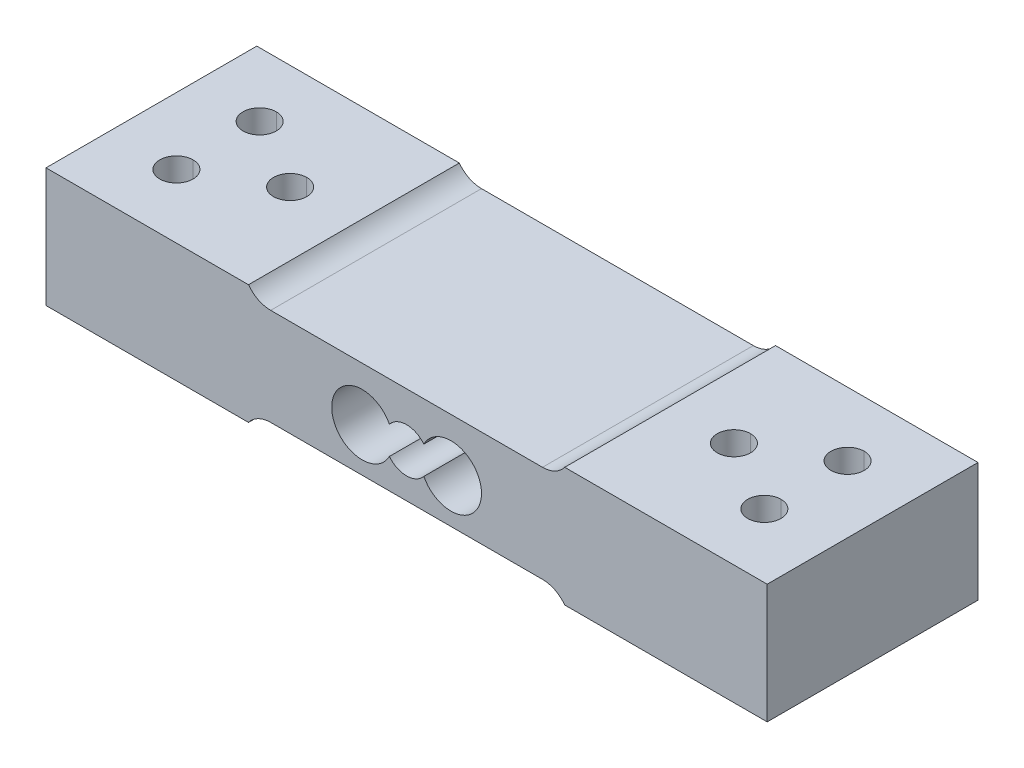
ISO-10303-21;
HEADER;
FILE_DESCRIPTION(('STEP AP214'),'2;1');
FILE_NAME('part.step','',(''),(''),'','','');
FILE_SCHEMA(('AUTOMOTIVE_DESIGN { 1 0 10303 214 1 1 1 1 }'));
ENDSEC;
DATA;
#1=APPLICATION_CONTEXT('core data for automotive mechanical design processes');
#2=APPLICATION_PROTOCOL_DEFINITION('international standard','automotive_design',2000,#1);
#3=PRODUCT_CONTEXT('',#1,'mechanical');
#4=PRODUCT('Part','Part','',(#3));
#5=PRODUCT_RELATED_PRODUCT_CATEGORY('part','',(#4));
#6=PRODUCT_DEFINITION_FORMATION('','',#4);
#7=PRODUCT_DEFINITION_CONTEXT('part definition',#1,'design');
#8=PRODUCT_DEFINITION('design','',#6,#7);
#9=PRODUCT_DEFINITION_SHAPE('','',#8);
#10=(LENGTH_UNIT() NAMED_UNIT(*) SI_UNIT(.MILLI.,.METRE.));
#11=(NAMED_UNIT(*) PLANE_ANGLE_UNIT() SI_UNIT($,.RADIAN.));
#12=(NAMED_UNIT(*) SI_UNIT($,.STERADIAN.) SOLID_ANGLE_UNIT());
#13=UNCERTAINTY_MEASURE_WITH_UNIT(LENGTH_MEASURE(1.E-05),#10,'distance_accuracy_value','');
#14=(GEOMETRIC_REPRESENTATION_CONTEXT(3) GLOBAL_UNCERTAINTY_ASSIGNED_CONTEXT((#13)) GLOBAL_UNIT_ASSIGNED_CONTEXT((#10,
#11,#12)) REPRESENTATION_CONTEXT('',''));
#15=CARTESIAN_POINT('',(0.,0.,0.));
#16=DIRECTION('',(0.,0.,1.));
#17=DIRECTION('',(1.,0.,0.));
#18=AXIS2_PLACEMENT_3D('',#15,#16,#17);
#19=CARTESIAN_POINT('',(0.,9.90073869788244,-19.001));
#20=DIRECTION('',(0.,0.,1.));
#21=DIRECTION('',(1.,0.,0.));
#22=AXIS2_PLACEMENT_3D('',#19,#20,#21);
#23=CYLINDRICAL_SURFACE('',#22,4.);
#24=CARTESIAN_POINT('',(0.,9.90073869788244,-19.));
#25=DIRECTION('',(0.,0.,-1.));
#26=DIRECTION('',(1.,0.,0.));
#27=AXIS2_PLACEMENT_3D('',#24,#25,#26);
#28=CIRCLE('',#27,4.);
#29=CARTESIAN_POINT('',(-3.109375,12.4170429540039,-19.));
#30=VERTEX_POINT('',#29);
#31=CARTESIAN_POINT('',(3.109375,12.4170429540039,-19.));
#32=VERTEX_POINT('',#31);
#33=EDGE_CURVE('E291',#30,#32,#28,.T.);
#34=ORIENTED_EDGE('',*,*,#33,.T.);
#35=DIRECTION('',(0.,0.,1.));
#36=VECTOR('',#35,1.);
#37=CARTESIAN_POINT('',(3.109375,12.4170429540039,-19.001));
#38=LINE('',#37,#36);
#39=CARTESIAN_POINT('',(3.109375,12.4170429540039,19.));
#40=VERTEX_POINT('',#39);
#41=EDGE_CURVE('E415',#32,#40,#38,.T.);
#42=ORIENTED_EDGE('',*,*,#41,.T.);
#43=CARTESIAN_POINT('',(0.,9.90073869788244,19.));
#44=DIRECTION('',(0.,0.,1.));
#45=DIRECTION('',(1.,0.,0.));
#46=AXIS2_PLACEMENT_3D('',#43,#44,#45);
#47=CIRCLE('',#46,4.);
#48=CARTESIAN_POINT('',(-3.109375,12.4170429540039,19.));
#49=VERTEX_POINT('',#48);
#50=EDGE_CURVE('E312',#40,#49,#47,.T.);
#51=ORIENTED_EDGE('',*,*,#50,.T.);
#52=DIRECTION('',(0.,0.,1.));
#53=VECTOR('',#52,1.);
#54=CARTESIAN_POINT('',(-3.109375,12.4170429540039,-19.001));
#55=LINE('',#54,#53);
#56=EDGE_CURVE('E11',#30,#49,#55,.T.);
#57=ORIENTED_EDGE('',*,*,#56,.F.);
#58=EDGE_LOOP('',(#34,#42,#51,#57));
#59=FACE_BOUND('',#58,.T.);
#60=ADVANCED_FACE('F16',(#59),#23,.F.);
#61=CARTESIAN_POINT('',(-8.,9.90073869788244,-19.001));
#62=DIRECTION('',(0.,0.,1.));
#63=DIRECTION('',(1.,0.,0.));
#64=AXIS2_PLACEMENT_3D('',#61,#62,#63);
#65=CYLINDRICAL_SURFACE('',#64,5.5);
#66=CARTESIAN_POINT('',(-8.,9.90073869788244,-19.));
#67=DIRECTION('',(0.,0.,-1.));
#68=DIRECTION('',(1.,0.,0.));
#69=AXIS2_PLACEMENT_3D('',#66,#67,#68);
#70=CIRCLE('',#69,5.5);
#71=CARTESIAN_POINT('',(-3.109375,7.38443444176097,-19.));
#72=VERTEX_POINT('',#71);
#73=EDGE_CURVE('E395',#72,#30,#70,.T.);
#74=ORIENTED_EDGE('',*,*,#73,.T.);
#75=ORIENTED_EDGE('',*,*,#56,.T.);
#76=CARTESIAN_POINT('',(-8.,9.90073869788244,19.));
#77=DIRECTION('',(0.,0.,1.));
#78=DIRECTION('',(1.,0.,0.));
#79=AXIS2_PLACEMENT_3D('',#76,#77,#78);
#80=CIRCLE('',#79,5.5);
#81=CARTESIAN_POINT('',(-3.109375,7.38443444176097,19.));
#82=VERTEX_POINT('',#81);
#83=EDGE_CURVE('E315',#49,#82,#80,.T.);
#84=ORIENTED_EDGE('',*,*,#83,.T.);
#85=DIRECTION('',(0.,0.,1.));
#86=VECTOR('',#85,1.);
#87=CARTESIAN_POINT('',(-3.109375,7.38443444176097,-19.001));
#88=LINE('',#87,#86);
#89=EDGE_CURVE('E26',#72,#82,#88,.T.);
#90=ORIENTED_EDGE('',*,*,#89,.F.);
#91=EDGE_LOOP('',(#74,#75,#84,#90));
#92=FACE_BOUND('',#91,.T.);
#93=ADVANCED_FACE('F1294',(#92),#65,.F.);
#94=CARTESIAN_POINT('',(0.,9.90073869788244,-19.001));
#95=DIRECTION('',(0.,0.,1.));
#96=DIRECTION('',(1.,0.,0.));
#97=AXIS2_PLACEMENT_3D('',#94,#95,#96);
#98=CYLINDRICAL_SURFACE('',#97,4.);
#99=CARTESIAN_POINT('',(0.,9.90073869788244,-19.));
#100=DIRECTION('',(0.,0.,-1.));
#101=DIRECTION('',(1.,0.,0.));
#102=AXIS2_PLACEMENT_3D('',#99,#100,#101);
#103=CIRCLE('',#102,4.);
#104=CARTESIAN_POINT('',(3.109375,7.38443444176098,-19.));
#105=VERTEX_POINT('',#104);
#106=EDGE_CURVE('E292',#105,#72,#103,.T.);
#107=ORIENTED_EDGE('',*,*,#106,.T.);
#108=ORIENTED_EDGE('',*,*,#89,.T.);
#109=CARTESIAN_POINT('',(0.,9.90073869788244,19.));
#110=DIRECTION('',(0.,0.,1.));
#111=DIRECTION('',(1.,0.,0.));
#112=AXIS2_PLACEMENT_3D('',#109,#110,#111);
#113=CIRCLE('',#112,4.);
#114=CARTESIAN_POINT('',(3.109375,7.38443444176098,19.));
#115=VERTEX_POINT('',#114);
#116=EDGE_CURVE('E311',#82,#115,#113,.T.);
#117=ORIENTED_EDGE('',*,*,#116,.T.);
#118=DIRECTION('',(0.,0.,1.));
#119=VECTOR('',#118,1.);
#120=CARTESIAN_POINT('',(3.109375,7.38443444176098,-19.001));
#121=LINE('',#120,#119);
#122=EDGE_CURVE('E319',#105,#115,#121,.T.);
#123=ORIENTED_EDGE('',*,*,#122,.F.);
#124=EDGE_LOOP('',(#107,#108,#117,#123));
#125=FACE_BOUND('',#124,.T.);
#126=ADVANCED_FACE('F1290',(#125),#98,.F.);
#127=CARTESIAN_POINT('',(8.,9.90073869788244,-19.001));
#128=DIRECTION('',(0.,0.,1.));
#129=DIRECTION('',(1.,0.,0.));
#130=AXIS2_PLACEMENT_3D('',#127,#128,#129);
#131=CYLINDRICAL_SURFACE('',#130,5.5);
#132=DIRECTION('',(0.,0.,1.));
#133=VECTOR('',#132,1.);
#134=CARTESIAN_POINT('',(13.5,9.90073869788244,-19.001));
#135=LINE('',#134,#133);
#136=CARTESIAN_POINT('',(13.5,9.90073869788244,-19.));
#137=VERTEX_POINT('',#136);
#138=CARTESIAN_POINT('',(13.5,9.90073869788244,19.));
#139=VERTEX_POINT('',#138);
#140=EDGE_CURVE('E416',#137,#139,#135,.T.);
#141=ORIENTED_EDGE('',*,*,#140,.F.);
#142=CARTESIAN_POINT('',(8.,9.90073869788244,-19.));
#143=DIRECTION('',(0.,0.,-1.));
#144=DIRECTION('',(1.,0.,0.));
#145=AXIS2_PLACEMENT_3D('',#142,#143,#144);
#146=CIRCLE('',#145,5.5);
#147=EDGE_CURVE('E287',#137,#105,#146,.T.);
#148=ORIENTED_EDGE('',*,*,#147,.T.);
#149=ORIENTED_EDGE('',*,*,#122,.T.);
#150=CARTESIAN_POINT('',(8.,9.90073869788244,19.));
#151=DIRECTION('',(0.,0.,1.));
#152=DIRECTION('',(1.,0.,0.));
#153=AXIS2_PLACEMENT_3D('',#150,#151,#152);
#154=CIRCLE('',#153,5.5);
#155=EDGE_CURVE('E308',#115,#139,#154,.T.);
#156=ORIENTED_EDGE('',*,*,#155,.T.);
#157=EDGE_LOOP('',(#141,#148,#149,#156));
#158=FACE_BOUND('',#157,.T.);
#159=ADVANCED_FACE('F1233',(#158),#131,.F.);
#160=CARTESIAN_POINT('',(52.9903810567666,0.,-7.5));
#161=DIRECTION('',(0.,1.,0.));
#162=DIRECTION('',(0.,0.,1.));
#163=AXIS2_PLACEMENT_3D('',#160,#161,#162);
#164=CYLINDRICAL_SURFACE('',#163,3.);
#165=DIRECTION('',(0.,1.,0.));
#166=VECTOR('',#165,1.);
#167=CARTESIAN_POINT('',(52.9903810567666,0.,-10.5));
#168=LINE('',#167,#166);
#169=CARTESIAN_POINT('',(52.9903810567666,0.,-10.5));
#170=VERTEX_POINT('',#169);
#171=CARTESIAN_POINT('',(52.9903810567666,21.5,-10.5));
#172=VERTEX_POINT('',#171);
#173=EDGE_CURVE('E282',#170,#172,#168,.T.);
#174=ORIENTED_EDGE('',*,*,#173,.F.);
#175=CARTESIAN_POINT('',(52.9903810567666,0.,-7.5));
#176=DIRECTION('',(0.,1.,0.));
#177=DIRECTION('',(0.,0.,-1.));
#178=AXIS2_PLACEMENT_3D('',#175,#176,#177);
#179=CIRCLE('',#178,3.);
#180=CARTESIAN_POINT('',(52.9903810567666,0.,-4.5));
#181=VERTEX_POINT('',#180);
#182=EDGE_CURVE('E254',#181,#170,#179,.T.);
#183=ORIENTED_EDGE('',*,*,#182,.F.);
#184=DIRECTION('',(0.,1.,0.));
#185=VECTOR('',#184,1.);
#186=CARTESIAN_POINT('',(52.9903810567666,0.,-4.5));
#187=LINE('',#186,#185);
#188=CARTESIAN_POINT('',(52.9903810567666,21.5,-4.5));
#189=VERTEX_POINT('',#188);
#190=EDGE_CURVE('E267',#181,#189,#187,.T.);
#191=ORIENTED_EDGE('',*,*,#190,.T.);
#192=CARTESIAN_POINT('',(52.9903810567666,21.5,-7.5));
#193=DIRECTION('',(0.,1.,0.));
#194=DIRECTION('',(0.,0.,-1.));
#195=AXIS2_PLACEMENT_3D('',#192,#193,#194);
#196=CIRCLE('',#195,3.);
#197=EDGE_CURVE('E463',#189,#172,#196,.T.);
#198=ORIENTED_EDGE('',*,*,#197,.T.);
#199=EDGE_LOOP('',(#174,#183,#191,#198));
#200=FACE_BOUND('',#199,.T.);
#201=ADVANCED_FACE('F1229',(#200),#164,.F.);
#202=CARTESIAN_POINT('',(40.,0.,0.));
#203=DIRECTION('',(0.,1.,0.));
#204=DIRECTION('',(0.,0.,1.));
#205=AXIS2_PLACEMENT_3D('',#202,#203,#204);
#206=CYLINDRICAL_SURFACE('',#205,3.);
#207=DIRECTION('',(0.,1.,0.));
#208=VECTOR('',#207,1.);
#209=CARTESIAN_POINT('',(40.,0.,-3.));
#210=LINE('',#209,#208);
#211=CARTESIAN_POINT('',(40.,0.,-3.));
#212=VERTEX_POINT('',#211);
#213=CARTESIAN_POINT('',(40.,21.5,-3.));
#214=VERTEX_POINT('',#213);
#215=EDGE_CURVE('E248',#212,#214,#210,.T.);
#216=ORIENTED_EDGE('',*,*,#215,.F.);
#217=CARTESIAN_POINT('',(40.,0.,0.));
#218=DIRECTION('',(0.,1.,0.));
#219=DIRECTION('',(0.,0.,-1.));
#220=AXIS2_PLACEMENT_3D('',#217,#218,#219);
#221=CIRCLE('',#220,3.);
#222=CARTESIAN_POINT('',(40.,0.,3.));
#223=VERTEX_POINT('',#222);
#224=EDGE_CURVE('E242',#223,#212,#221,.T.);
#225=ORIENTED_EDGE('',*,*,#224,.F.);
#226=DIRECTION('',(0.,1.,0.));
#227=VECTOR('',#226,1.);
#228=CARTESIAN_POINT('',(40.,0.,3.));
#229=LINE('',#228,#227);
#230=CARTESIAN_POINT('',(40.,21.5,3.));
#231=VERTEX_POINT('',#230);
#232=EDGE_CURVE('E245',#223,#231,#229,.T.);
#233=ORIENTED_EDGE('',*,*,#232,.T.);
#234=CARTESIAN_POINT('',(40.,21.5,0.));
#235=DIRECTION('',(0.,1.,0.));
#236=DIRECTION('',(0.,0.,-1.));
#237=AXIS2_PLACEMENT_3D('',#234,#235,#236);
#238=CIRCLE('',#237,3.);
#239=EDGE_CURVE('E466',#231,#214,#238,.T.);
#240=ORIENTED_EDGE('',*,*,#239,.T.);
#241=EDGE_LOOP('',(#216,#225,#233,#240));
#242=FACE_BOUND('',#241,.T.);
#243=ADVANCED_FACE('F244',(#242),#206,.F.);
#244=CARTESIAN_POINT('',(52.9903810567666,0.,7.5));
#245=DIRECTION('',(0.,1.,0.));
#246=DIRECTION('',(0.,0.,1.));
#247=AXIS2_PLACEMENT_3D('',#244,#245,#246);
#248=CYLINDRICAL_SURFACE('',#247,3.);
#249=DIRECTION('',(0.,1.,0.));
#250=VECTOR('',#249,1.);
#251=CARTESIAN_POINT('',(52.9903810567666,0.,4.5));
#252=LINE('',#251,#250);
#253=CARTESIAN_POINT('',(52.9903810567666,0.,4.5));
#254=VERTEX_POINT('',#253);
#255=CARTESIAN_POINT('',(52.9903810567666,21.5,4.5));
#256=VERTEX_POINT('',#255);
#257=EDGE_CURVE('E365',#254,#256,#252,.T.);
#258=ORIENTED_EDGE('',*,*,#257,.F.);
#259=CARTESIAN_POINT('',(52.9903810567666,0.,7.5));
#260=DIRECTION('',(0.,1.,0.));
#261=DIRECTION('',(0.,0.,-1.));
#262=AXIS2_PLACEMENT_3D('',#259,#260,#261);
#263=CIRCLE('',#262,3.);
#264=CARTESIAN_POINT('',(52.9903810567666,0.,10.5));
#265=VERTEX_POINT('',#264);
#266=EDGE_CURVE('E253',#265,#254,#263,.T.);
#267=ORIENTED_EDGE('',*,*,#266,.F.);
#268=DIRECTION('',(0.,1.,0.));
#269=VECTOR('',#268,1.);
#270=CARTESIAN_POINT('',(52.9903810567666,0.,10.5));
#271=LINE('',#270,#269);
#272=CARTESIAN_POINT('',(52.9903810567666,21.5,10.5));
#273=VERTEX_POINT('',#272);
#274=EDGE_CURVE('E410',#265,#273,#271,.T.);
#275=ORIENTED_EDGE('',*,*,#274,.T.);
#276=CARTESIAN_POINT('',(52.9903810567666,21.5,7.5));
#277=DIRECTION('',(0.,1.,0.));
#278=DIRECTION('',(0.,0.,-1.));
#279=AXIS2_PLACEMENT_3D('',#276,#277,#278);
#280=CIRCLE('',#279,3.);
#281=EDGE_CURVE('E208',#273,#256,#280,.T.);
#282=ORIENTED_EDGE('',*,*,#281,.T.);
#283=EDGE_LOOP('',(#258,#267,#275,#282));
#284=FACE_BOUND('',#283,.T.);
#285=ADVANCED_FACE('F1159',(#284),#248,.F.);
#286=CARTESIAN_POINT('',(-52.9903810567666,0.,7.5));
#287=DIRECTION('',(0.,1.,0.));
#288=DIRECTION('',(0.,0.,1.));
#289=AXIS2_PLACEMENT_3D('',#286,#287,#288);
#290=CYLINDRICAL_SURFACE('',#289,3.);
#291=DIRECTION('',(0.,1.,0.));
#292=VECTOR('',#291,1.);
#293=CARTESIAN_POINT('',(-52.9903810567666,0.,4.5));
#294=LINE('',#293,#292);
#295=CARTESIAN_POINT('',(-52.9903810567666,0.,4.5));
#296=VERTEX_POINT('',#295);
#297=CARTESIAN_POINT('',(-52.9903810567666,21.5,4.5));
#298=VERTEX_POINT('',#297);
#299=EDGE_CURVE('E409',#296,#298,#294,.T.);
#300=ORIENTED_EDGE('',*,*,#299,.F.);
#301=CARTESIAN_POINT('',(-52.9903810567666,0.,7.5));
#302=DIRECTION('',(0.,1.,0.));
#303=DIRECTION('',(0.,0.,1.));
#304=AXIS2_PLACEMENT_3D('',#301,#302,#303);
#305=CIRCLE('',#304,3.);
#306=CARTESIAN_POINT('',(-52.9903810567666,0.,10.5));
#307=VERTEX_POINT('',#306);
#308=EDGE_CURVE('E383',#307,#296,#305,.T.);
#309=ORIENTED_EDGE('',*,*,#308,.F.);
#310=DIRECTION('',(0.,1.,0.));
#311=VECTOR('',#310,1.);
#312=CARTESIAN_POINT('',(-52.9903810567666,0.,10.5));
#313=LINE('',#312,#311);
#314=CARTESIAN_POINT('',(-52.9903810567666,21.5,10.5));
#315=VERTEX_POINT('',#314);
#316=EDGE_CURVE('E328',#307,#315,#313,.T.);
#317=ORIENTED_EDGE('',*,*,#316,.T.);
#318=CARTESIAN_POINT('',(-52.9903810567666,21.5,7.5));
#319=DIRECTION('',(0.,1.,0.));
#320=DIRECTION('',(0.,0.,1.));
#321=AXIS2_PLACEMENT_3D('',#318,#319,#320);
#322=CIRCLE('',#321,3.);
#323=EDGE_CURVE('E404',#315,#298,#322,.T.);
#324=ORIENTED_EDGE('',*,*,#323,.T.);
#325=EDGE_LOOP('',(#300,#309,#317,#324));
#326=FACE_BOUND('',#325,.T.);
#327=ADVANCED_FACE('F566',(#326),#290,.F.);
#328=CARTESIAN_POINT('',(-40.,0.,0.));
#329=DIRECTION('',(0.,1.,0.));
#330=DIRECTION('',(0.,0.,1.));
#331=AXIS2_PLACEMENT_3D('',#328,#329,#330);
#332=CYLINDRICAL_SURFACE('',#331,3.);
#333=DIRECTION('',(0.,1.,0.));
#334=VECTOR('',#333,1.);
#335=CARTESIAN_POINT('',(-40.,0.,-3.));
#336=LINE('',#335,#334);
#337=CARTESIAN_POINT('',(-40.,0.,-3.));
#338=VERTEX_POINT('',#337);
#339=CARTESIAN_POINT('',(-40.,21.5,-3.));
#340=VERTEX_POINT('',#339);
#341=EDGE_CURVE('E327',#338,#340,#336,.T.);
#342=ORIENTED_EDGE('',*,*,#341,.F.);
#343=CARTESIAN_POINT('',(-40.,0.,0.));
#344=DIRECTION('',(0.,1.,0.));
#345=DIRECTION('',(0.,0.,1.));
#346=AXIS2_PLACEMENT_3D('',#343,#344,#345);
#347=CIRCLE('',#346,3.);
#348=CARTESIAN_POINT('',(-40.,0.,3.));
#349=VERTEX_POINT('',#348);
#350=EDGE_CURVE('E347',#349,#338,#347,.T.);
#351=ORIENTED_EDGE('',*,*,#350,.F.);
#352=DIRECTION('',(0.,1.,0.));
#353=VECTOR('',#352,1.);
#354=CARTESIAN_POINT('',(-40.,0.,3.));
#355=LINE('',#354,#353);
#356=CARTESIAN_POINT('',(-40.,21.5,3.));
#357=VERTEX_POINT('',#356);
#358=EDGE_CURVE('E374',#349,#357,#355,.T.);
#359=ORIENTED_EDGE('',*,*,#358,.T.);
#360=CARTESIAN_POINT('',(-40.,21.5,0.));
#361=DIRECTION('',(0.,1.,0.));
#362=DIRECTION('',(0.,0.,1.));
#363=AXIS2_PLACEMENT_3D('',#360,#361,#362);
#364=CIRCLE('',#363,3.);
#365=EDGE_CURVE('E401',#357,#340,#364,.T.);
#366=ORIENTED_EDGE('',*,*,#365,.T.);
#367=EDGE_LOOP('',(#342,#351,#359,#366));
#368=FACE_BOUND('',#367,.T.);
#369=ADVANCED_FACE('F1141',(#368),#332,.F.);
#370=CARTESIAN_POINT('',(-52.9903810567666,0.,-7.5));
#371=DIRECTION('',(0.,1.,0.));
#372=DIRECTION('',(0.,0.,1.));
#373=AXIS2_PLACEMENT_3D('',#370,#371,#372);
#374=CYLINDRICAL_SURFACE('',#373,3.);
#375=DIRECTION('',(0.,1.,0.));
#376=VECTOR('',#375,1.);
#377=CARTESIAN_POINT('',(-52.9903810567666,0.,-10.5));
#378=LINE('',#377,#376);
#379=CARTESIAN_POINT('',(-52.9903810567666,0.,-10.5));
#380=VERTEX_POINT('',#379);
#381=CARTESIAN_POINT('',(-52.9903810567666,21.5,-10.5));
#382=VERTEX_POINT('',#381);
#383=EDGE_CURVE('E301',#380,#382,#378,.T.);
#384=ORIENTED_EDGE('',*,*,#383,.F.);
#385=CARTESIAN_POINT('',(-52.9903810567666,0.,-7.5));
#386=DIRECTION('',(0.,1.,0.));
#387=DIRECTION('',(0.,0.,1.));
#388=AXIS2_PLACEMENT_3D('',#385,#386,#387);
#389=CIRCLE('',#388,3.);
#390=CARTESIAN_POINT('',(-52.9903810567666,0.,-4.5));
#391=VERTEX_POINT('',#390);
#392=EDGE_CURVE('E343',#391,#380,#389,.T.);
#393=ORIENTED_EDGE('',*,*,#392,.F.);
#394=DIRECTION('',(0.,1.,0.));
#395=VECTOR('',#394,1.);
#396=CARTESIAN_POINT('',(-52.9903810567666,0.,-4.5));
#397=LINE('',#396,#395);
#398=CARTESIAN_POINT('',(-52.9903810567666,21.5,-4.5));
#399=VERTEX_POINT('',#398);
#400=EDGE_CURVE('E300',#391,#399,#397,.T.);
#401=ORIENTED_EDGE('',*,*,#400,.T.);
#402=CARTESIAN_POINT('',(-52.9903810567666,21.5,-7.5));
#403=DIRECTION('',(0.,1.,0.));
#404=DIRECTION('',(0.,0.,1.));
#405=AXIS2_PLACEMENT_3D('',#402,#403,#404);
#406=CIRCLE('',#405,3.);
#407=EDGE_CURVE('E399',#399,#382,#406,.T.);
#408=ORIENTED_EDGE('',*,*,#407,.T.);
#409=EDGE_LOOP('',(#384,#393,#401,#408));
#410=FACE_BOUND('',#409,.T.);
#411=ADVANCED_FACE('F806',(#410),#374,.F.);
#412=CARTESIAN_POINT('',(-24.5,-3.,-19.));
#413=DIRECTION('',(0.,0.,1.));
#414=DIRECTION('',(1.,0.,0.));
#415=AXIS2_PLACEMENT_3D('',#412,#413,#414);
#416=CYLINDRICAL_SURFACE('',#415,5.);
#417=CARTESIAN_POINT('',(-24.5,-3.,-19.));
#418=DIRECTION('',(0.,0.,1.));
#419=DIRECTION('',(1.,0.,0.));
#420=AXIS2_PLACEMENT_3D('',#417,#418,#419);
#421=CIRCLE('',#420,5.);
#422=CARTESIAN_POINT('',(-24.5,2.,-19.));
#423=VERTEX_POINT('',#422);
#424=CARTESIAN_POINT('',(-28.5,0.,-19.));
#425=VERTEX_POINT('',#424);
#426=EDGE_CURVE('E487',#423,#425,#421,.T.);
#427=ORIENTED_EDGE('',*,*,#426,.F.);
#428=DIRECTION('',(0.,0.,-1.));
#429=VECTOR('',#428,1.);
#430=CARTESIAN_POINT('',(-24.5,2.,-19.));
#431=LINE('',#430,#429);
#432=CARTESIAN_POINT('',(-24.5,2.,19.));
#433=VERTEX_POINT('',#432);
#434=EDGE_CURVE('E316',#433,#423,#431,.T.);
#435=ORIENTED_EDGE('',*,*,#434,.F.);
#436=CARTESIAN_POINT('',(-24.5,-3.,19.));
#437=DIRECTION('',(0.,0.,-1.));
#438=DIRECTION('',(-1.,0.,0.));
#439=AXIS2_PLACEMENT_3D('',#436,#437,#438);
#440=CIRCLE('',#439,5.);
#441=CARTESIAN_POINT('',(-28.5,0.,19.));
#442=VERTEX_POINT('',#441);
#443=EDGE_CURVE('E354',#442,#433,#440,.T.);
#444=ORIENTED_EDGE('',*,*,#443,.F.);
#445=DIRECTION('',(0.,0.,1.));
#446=VECTOR('',#445,1.);
#447=CARTESIAN_POINT('',(-28.5,0.,-19.));
#448=LINE('',#447,#446);
#449=EDGE_CURVE('E339',#425,#442,#448,.T.);
#450=ORIENTED_EDGE('',*,*,#449,.F.);
#451=EDGE_LOOP('',(#427,#435,#444,#450));
#452=FACE_BOUND('',#451,.T.);
#453=ADVANCED_FACE('F824',(#452),#416,.F.);
#454=CARTESIAN_POINT('',(24.5,-3.,-19.));
#455=DIRECTION('',(0.,0.,-1.));
#456=DIRECTION('',(-1.,0.,0.));
#457=AXIS2_PLACEMENT_3D('',#454,#455,#456);
#458=CYLINDRICAL_SURFACE('',#457,5.);
#459=CARTESIAN_POINT('',(24.5,-3.,19.));
#460=DIRECTION('',(0.,0.,-1.));
#461=DIRECTION('',(-1.,0.,0.));
#462=AXIS2_PLACEMENT_3D('',#459,#460,#461);
#463=CIRCLE('',#462,5.);
#464=CARTESIAN_POINT('',(24.5,2.,19.));
#465=VERTEX_POINT('',#464);
#466=CARTESIAN_POINT('',(28.5,0.,19.));
#467=VERTEX_POINT('',#466);
#468=EDGE_CURVE('E432',#465,#467,#463,.T.);
#469=ORIENTED_EDGE('',*,*,#468,.F.);
#470=DIRECTION('',(0.,0.,1.));
#471=VECTOR('',#470,1.);
#472=CARTESIAN_POINT('',(24.5,2.,19.));
#473=LINE('',#472,#471);
#474=CARTESIAN_POINT('',(24.5,2.,-19.));
#475=VERTEX_POINT('',#474);
#476=EDGE_CURVE('E320',#475,#465,#473,.T.);
#477=ORIENTED_EDGE('',*,*,#476,.F.);
#478=CARTESIAN_POINT('',(24.5,-3.,-19.));
#479=DIRECTION('',(0.,0.,1.));
#480=DIRECTION('',(1.,0.,0.));
#481=AXIS2_PLACEMENT_3D('',#478,#479,#480);
#482=CIRCLE('',#481,5.);
#483=CARTESIAN_POINT('',(28.5,0.,-19.));
#484=VERTEX_POINT('',#483);
#485=EDGE_CURVE('E329',#484,#475,#482,.T.);
#486=ORIENTED_EDGE('',*,*,#485,.F.);
#487=DIRECTION('',(0.,0.,-1.));
#488=VECTOR('',#487,1.);
#489=CARTESIAN_POINT('',(28.5,0.,-19.));
#490=LINE('',#489,#488);
#491=EDGE_CURVE('E335',#467,#484,#490,.T.);
#492=ORIENTED_EDGE('',*,*,#491,.F.);
#493=EDGE_LOOP('',(#469,#477,#486,#492));
#494=FACE_BOUND('',#493,.T.);
#495=ADVANCED_FACE('F1179',(#494),#458,.F.);
#496=CARTESIAN_POINT('',(24.5,24.5,-19.));
#497=DIRECTION('',(0.,0.,1.));
#498=DIRECTION('',(1.,0.,0.));
#499=AXIS2_PLACEMENT_3D('',#496,#497,#498);
#500=CYLINDRICAL_SURFACE('',#499,5.);
#501=CARTESIAN_POINT('',(24.5,24.5,19.));
#502=DIRECTION('',(0.,0.,-1.));
#503=DIRECTION('',(-1.,0.,0.));
#504=AXIS2_PLACEMENT_3D('',#501,#502,#503);
#505=CIRCLE('',#504,5.);
#506=CARTESIAN_POINT('',(28.5,21.5,19.));
#507=VERTEX_POINT('',#506);
#508=CARTESIAN_POINT('',(24.5,19.5,19.));
#509=VERTEX_POINT('',#508);
#510=EDGE_CURVE('E302',#507,#509,#505,.T.);
#511=ORIENTED_EDGE('',*,*,#510,.F.);
#512=DIRECTION('',(0.,0.,-1.));
#513=VECTOR('',#512,1.);
#514=CARTESIAN_POINT('',(28.5,21.5,-19.));
#515=LINE('',#514,#513);
#516=CARTESIAN_POINT('',(28.5,21.5,-19.));
#517=VERTEX_POINT('',#516);
#518=EDGE_CURVE('E346',#507,#517,#515,.T.);
#519=ORIENTED_EDGE('',*,*,#518,.T.);
#520=CARTESIAN_POINT('',(24.5,24.5,-19.));
#521=DIRECTION('',(0.,0.,1.));
#522=DIRECTION('',(1.,0.,0.));
#523=AXIS2_PLACEMENT_3D('',#520,#521,#522);
#524=CIRCLE('',#523,5.);
#525=CARTESIAN_POINT('',(24.5,19.5,-19.));
#526=VERTEX_POINT('',#525);
#527=EDGE_CURVE('E422',#526,#517,#524,.T.);
#528=ORIENTED_EDGE('',*,*,#527,.F.);
#529=DIRECTION('',(0.,0.,-1.));
#530=VECTOR('',#529,1.);
#531=CARTESIAN_POINT('',(24.5,19.5,-19.));
#532=LINE('',#531,#530);
#533=EDGE_CURVE('E398',#509,#526,#532,.T.);
#534=ORIENTED_EDGE('',*,*,#533,.F.);
#535=EDGE_LOOP('',(#511,#519,#528,#534));
#536=FACE_BOUND('',#535,.T.);
#537=ADVANCED_FACE('F1152',(#536),#500,.F.);
#538=CARTESIAN_POINT('',(-24.5,24.5,-19.));
#539=DIRECTION('',(0.,0.,-1.));
#540=DIRECTION('',(-1.,0.,0.));
#541=AXIS2_PLACEMENT_3D('',#538,#539,#540);
#542=CYLINDRICAL_SURFACE('',#541,5.);
#543=CARTESIAN_POINT('',(-24.5,24.5,-19.));
#544=DIRECTION('',(0.,0.,1.));
#545=DIRECTION('',(1.,0.,0.));
#546=AXIS2_PLACEMENT_3D('',#543,#544,#545);
#547=CIRCLE('',#546,5.);
#548=CARTESIAN_POINT('',(-28.5,21.5,-19.));
#549=VERTEX_POINT('',#548);
#550=CARTESIAN_POINT('',(-24.5,19.5,-19.));
#551=VERTEX_POINT('',#550);
#552=EDGE_CURVE('E352',#549,#551,#547,.T.);
#553=ORIENTED_EDGE('',*,*,#552,.F.);
#554=DIRECTION('',(0.,0.,1.));
#555=VECTOR('',#554,1.);
#556=CARTESIAN_POINT('',(-28.5,21.5,-19.));
#557=LINE('',#556,#555);
#558=CARTESIAN_POINT('',(-28.5,21.5,19.));
#559=VERTEX_POINT('',#558);
#560=EDGE_CURVE('E455',#549,#559,#557,.T.);
#561=ORIENTED_EDGE('',*,*,#560,.T.);
#562=CARTESIAN_POINT('',(-24.5,24.5,19.));
#563=DIRECTION('',(0.,0.,-1.));
#564=DIRECTION('',(-1.,0.,0.));
#565=AXIS2_PLACEMENT_3D('',#562,#563,#564);
#566=CIRCLE('',#565,5.);
#567=CARTESIAN_POINT('',(-24.5,19.5,19.));
#568=VERTEX_POINT('',#567);
#569=EDGE_CURVE('E448',#568,#559,#566,.T.);
#570=ORIENTED_EDGE('',*,*,#569,.F.);
#571=DIRECTION('',(0.,0.,1.));
#572=VECTOR('',#571,1.);
#573=CARTESIAN_POINT('',(-24.5,19.5,19.));
#574=LINE('',#573,#572);
#575=EDGE_CURVE('E396',#551,#568,#574,.T.);
#576=ORIENTED_EDGE('',*,*,#575,.F.);
#577=EDGE_LOOP('',(#553,#561,#570,#576));
#578=FACE_BOUND('',#577,.T.);
#579=ADVANCED_FACE('F581',(#578),#542,.F.);
#580=CARTESIAN_POINT('',(0.,2.,0.));
#581=DIRECTION('',(0.,-1.,0.));
#582=DIRECTION('',(0.,0.,-1.));
#583=AXIS2_PLACEMENT_3D('',#580,#581,#582);
#584=PLANE('',#583);
#585=DIRECTION('',(-1.,0.,0.));
#586=VECTOR('',#585,1.);
#587=CARTESIAN_POINT('',(-28.5,2.,-19.));
#588=LINE('',#587,#586);
#589=EDGE_CURVE('E333',#475,#423,#588,.T.);
#590=ORIENTED_EDGE('',*,*,#589,.F.);
#591=ORIENTED_EDGE('',*,*,#476,.T.);
#592=DIRECTION('',(1.,0.,0.));
#593=VECTOR('',#592,1.);
#594=CARTESIAN_POINT('',(-28.5,2.,19.));
#595=LINE('',#594,#593);
#596=EDGE_CURVE('E437',#433,#465,#595,.T.);
#597=ORIENTED_EDGE('',*,*,#596,.F.);
#598=ORIENTED_EDGE('',*,*,#434,.T.);
#599=EDGE_LOOP('',(#590,#591,#597,#598));
#600=FACE_BOUND('',#599,.T.);
#601=ADVANCED_FACE('F1151',(#600),#584,.T.);
#602=CARTESIAN_POINT('',(0.,19.5,0.));
#603=DIRECTION('',(0.,1.,0.));
#604=DIRECTION('',(1.,0.,0.));
#605=AXIS2_PLACEMENT_3D('',#602,#603,#604);
#606=PLANE('',#605);
#607=DIRECTION('',(-1.,0.,0.));
#608=VECTOR('',#607,1.);
#609=CARTESIAN_POINT('',(-28.5,19.5,-19.));
#610=LINE('',#609,#608);
#611=EDGE_CURVE('E389',#526,#551,#610,.T.);
#612=ORIENTED_EDGE('',*,*,#611,.T.);
#613=ORIENTED_EDGE('',*,*,#575,.T.);
#614=DIRECTION('',(1.,0.,0.));
#615=VECTOR('',#614,1.);
#616=CARTESIAN_POINT('',(-28.5,19.5,19.));
#617=LINE('',#616,#615);
#618=EDGE_CURVE('E306',#568,#509,#617,.T.);
#619=ORIENTED_EDGE('',*,*,#618,.T.);
#620=ORIENTED_EDGE('',*,*,#533,.T.);
#621=EDGE_LOOP('',(#612,#613,#619,#620));
#622=FACE_BOUND('',#621,.T.);
#623=ADVANCED_FACE('F572',(#622),#606,.T.);
#624=CARTESIAN_POINT('',(0.,21.5,0.));
#625=DIRECTION('',(0.,1.,0.));
#626=DIRECTION('',(1.,0.,0.));
#627=AXIS2_PLACEMENT_3D('',#624,#625,#626);
#628=PLANE('',#627);
#629=ORIENTED_EDGE('',*,*,#407,.F.);
#630=CARTESIAN_POINT('',(-52.9903810567666,21.5,-7.5));
#631=DIRECTION('',(0.,1.,0.));
#632=DIRECTION('',(0.,0.,1.));
#633=AXIS2_PLACEMENT_3D('',#630,#631,#632);
#634=CIRCLE('',#633,3.);
#635=EDGE_CURVE('E296',#382,#399,#634,.T.);
#636=ORIENTED_EDGE('',*,*,#635,.F.);
#637=EDGE_LOOP('',(#629,#636));
#638=FACE_BOUND('',#637,.T.);
#639=ORIENTED_EDGE('',*,*,#365,.F.);
#640=CARTESIAN_POINT('',(-40.,21.5,0.));
#641=DIRECTION('',(0.,1.,0.));
#642=DIRECTION('',(0.,0.,1.));
#643=AXIS2_PLACEMENT_3D('',#640,#641,#642);
#644=CIRCLE('',#643,3.);
#645=EDGE_CURVE('E364',#340,#357,#644,.T.);
#646=ORIENTED_EDGE('',*,*,#645,.F.);
#647=EDGE_LOOP('',(#639,#646));
#648=FACE_BOUND('',#647,.T.);
#649=ORIENTED_EDGE('',*,*,#323,.F.);
#650=CARTESIAN_POINT('',(-52.9903810567666,21.5,7.5));
#651=DIRECTION('',(0.,1.,0.));
#652=DIRECTION('',(0.,0.,1.));
#653=AXIS2_PLACEMENT_3D('',#650,#651,#652);
#654=CIRCLE('',#653,3.);
#655=EDGE_CURVE('E467',#298,#315,#654,.T.);
#656=ORIENTED_EDGE('',*,*,#655,.F.);
#657=EDGE_LOOP('',(#649,#656));
#658=FACE_BOUND('',#657,.T.);
#659=ORIENTED_EDGE('',*,*,#560,.F.);
#660=DIRECTION('',(-1.,0.,0.));
#661=VECTOR('',#660,1.);
#662=CARTESIAN_POINT('',(-65.,21.5,-19.));
#663=LINE('',#662,#661);
#664=CARTESIAN_POINT('',(-65.,21.5,-19.));
#665=VERTEX_POINT('',#664);
#666=EDGE_CURVE('E348',#549,#665,#663,.T.);
#667=ORIENTED_EDGE('',*,*,#666,.T.);
#668=DIRECTION('',(0.,0.,1.));
#669=VECTOR('',#668,1.);
#670=CARTESIAN_POINT('',(-65.,21.5,-19.));
#671=LINE('',#670,#669);
#672=CARTESIAN_POINT('',(-65.,21.5,19.));
#673=VERTEX_POINT('',#672);
#674=EDGE_CURVE('E452',#665,#673,#671,.T.);
#675=ORIENTED_EDGE('',*,*,#674,.T.);
#676=DIRECTION('',(1.,0.,0.));
#677=VECTOR('',#676,1.);
#678=CARTESIAN_POINT('',(-65.,21.5,19.));
#679=LINE('',#678,#677);
#680=EDGE_CURVE('E443',#673,#559,#679,.T.);
#681=ORIENTED_EDGE('',*,*,#680,.T.);
#682=EDGE_LOOP('',(#659,#667,#675,#681));
#683=FACE_BOUND('',#682,.T.);
#684=ADVANCED_FACE('F568',(#638,#648,#658,#683),#628,.T.);
#685=CARTESIAN_POINT('',(-65.,21.5,-19.));
#686=DIRECTION('',(1.,0.,0.));
#687=DIRECTION('',(0.,1.,0.));
#688=AXIS2_PLACEMENT_3D('',#685,#686,#687);
#689=PLANE('',#688);
#690=DIRECTION('',(0.,0.,1.));
#691=VECTOR('',#690,1.);
#692=CARTESIAN_POINT('',(-65.,0.,-19.));
#693=LINE('',#692,#691);
#694=CARTESIAN_POINT('',(-65.,0.,-19.));
#695=VERTEX_POINT('',#694);
#696=CARTESIAN_POINT('',(-65.,0.,19.));
#697=VERTEX_POINT('',#696);
#698=EDGE_CURVE('E342',#695,#697,#693,.T.);
#699=ORIENTED_EDGE('',*,*,#698,.T.);
#700=DIRECTION('',(0.,-1.,0.));
#701=VECTOR('',#700,1.);
#702=CARTESIAN_POINT('',(-65.,21.5,19.));
#703=LINE('',#702,#701);
#704=EDGE_CURVE('E447',#673,#697,#703,.T.);
#705=ORIENTED_EDGE('',*,*,#704,.F.);
#706=ORIENTED_EDGE('',*,*,#674,.F.);
#707=DIRECTION('',(0.,-1.,0.));
#708=VECTOR('',#707,1.);
#709=CARTESIAN_POINT('',(-65.,21.5,-19.));
#710=LINE('',#709,#708);
#711=EDGE_CURVE('E353',#665,#695,#710,.T.);
#712=ORIENTED_EDGE('',*,*,#711,.T.);
#713=EDGE_LOOP('',(#699,#705,#706,#712));
#714=FACE_BOUND('',#713,.T.);
#715=ADVANCED_FACE('F571',(#714),#689,.F.);
#716=CARTESIAN_POINT('',(65.,21.5,-19.));
#717=DIRECTION('',(-1.,0.,0.));
#718=DIRECTION('',(0.,1.,0.));
#719=AXIS2_PLACEMENT_3D('',#716,#717,#718);
#720=PLANE('',#719);
#721=DIRECTION('',(0.,0.,-1.));
#722=VECTOR('',#721,1.);
#723=CARTESIAN_POINT('',(65.,0.,-19.));
#724=LINE('',#723,#722);
#725=CARTESIAN_POINT('',(65.,0.,19.));
#726=VERTEX_POINT('',#725);
#727=CARTESIAN_POINT('',(65.,0.,-19.));
#728=VERTEX_POINT('',#727);
#729=EDGE_CURVE('E338',#726,#728,#724,.T.);
#730=ORIENTED_EDGE('',*,*,#729,.T.);
#731=DIRECTION('',(0.,-1.,0.));
#732=VECTOR('',#731,1.);
#733=CARTESIAN_POINT('',(65.,21.5,-19.));
#734=LINE('',#733,#732);
#735=CARTESIAN_POINT('',(65.,21.5,-19.));
#736=VERTEX_POINT('',#735);
#737=EDGE_CURVE('E360',#736,#728,#734,.T.);
#738=ORIENTED_EDGE('',*,*,#737,.F.);
#739=DIRECTION('',(0.,0.,-1.));
#740=VECTOR('',#739,1.);
#741=CARTESIAN_POINT('',(65.,21.5,-19.));
#742=LINE('',#741,#740);
#743=CARTESIAN_POINT('',(65.,21.5,19.));
#744=VERTEX_POINT('',#743);
#745=EDGE_CURVE('E451',#744,#736,#742,.T.);
#746=ORIENTED_EDGE('',*,*,#745,.F.);
#747=DIRECTION('',(0.,-1.,0.));
#748=VECTOR('',#747,1.);
#749=CARTESIAN_POINT('',(65.,21.5,19.));
#750=LINE('',#749,#748);
#751=EDGE_CURVE('E280',#744,#726,#750,.T.);
#752=ORIENTED_EDGE('',*,*,#751,.T.);
#753=EDGE_LOOP('',(#730,#738,#746,#752));
#754=FACE_BOUND('',#753,.T.);
#755=ADVANCED_FACE('F1172',(#754),#720,.F.);
#756=CARTESIAN_POINT('',(0.,21.5,0.));
#757=DIRECTION('',(0.,1.,0.));
#758=DIRECTION('',(1.,0.,0.));
#759=AXIS2_PLACEMENT_3D('',#756,#757,#758);
#760=PLANE('',#759);
#761=ORIENTED_EDGE('',*,*,#281,.F.);
#762=CARTESIAN_POINT('',(52.9903810567666,21.5,7.5));
#763=DIRECTION('',(0.,1.,0.));
#764=DIRECTION('',(0.,0.,-1.));
#765=AXIS2_PLACEMENT_3D('',#762,#763,#764);
#766=CIRCLE('',#765,3.);
#767=EDGE_CURVE('E369',#256,#273,#766,.T.);
#768=ORIENTED_EDGE('',*,*,#767,.F.);
#769=EDGE_LOOP('',(#761,#768));
#770=FACE_BOUND('',#769,.T.);
#771=ORIENTED_EDGE('',*,*,#239,.F.);
#772=CARTESIAN_POINT('',(40.,21.5,0.));
#773=DIRECTION('',(0.,1.,0.));
#774=DIRECTION('',(0.,0.,-1.));
#775=AXIS2_PLACEMENT_3D('',#772,#773,#774);
#776=CIRCLE('',#775,3.);
#777=EDGE_CURVE('E260',#214,#231,#776,.T.);
#778=ORIENTED_EDGE('',*,*,#777,.F.);
#779=EDGE_LOOP('',(#771,#778));
#780=FACE_BOUND('',#779,.T.);
#781=ORIENTED_EDGE('',*,*,#197,.F.);
#782=CARTESIAN_POINT('',(52.9903810567666,21.5,-7.5));
#783=DIRECTION('',(0.,1.,0.));
#784=DIRECTION('',(0.,0.,-1.));
#785=AXIS2_PLACEMENT_3D('',#782,#783,#784);
#786=CIRCLE('',#785,3.);
#787=EDGE_CURVE('E276',#172,#189,#786,.T.);
#788=ORIENTED_EDGE('',*,*,#787,.F.);
#789=EDGE_LOOP('',(#781,#788));
#790=FACE_BOUND('',#789,.T.);
#791=ORIENTED_EDGE('',*,*,#518,.F.);
#792=DIRECTION('',(1.,0.,0.));
#793=VECTOR('',#792,1.);
#794=CARTESIAN_POINT('',(-65.,21.5,19.));
#795=LINE('',#794,#793);
#796=EDGE_CURVE('E307',#507,#744,#795,.T.);
#797=ORIENTED_EDGE('',*,*,#796,.T.);
#798=ORIENTED_EDGE('',*,*,#745,.T.);
#799=DIRECTION('',(-1.,0.,0.));
#800=VECTOR('',#799,1.);
#801=CARTESIAN_POINT('',(-65.,21.5,-19.));
#802=LINE('',#801,#800);
#803=EDGE_CURVE('E382',#736,#517,#802,.T.);
#804=ORIENTED_EDGE('',*,*,#803,.T.);
#805=EDGE_LOOP('',(#791,#797,#798,#804));
#806=FACE_BOUND('',#805,.T.);
#807=ADVANCED_FACE('F816',(#770,#780,#790,#806),#760,.T.);
#808=CARTESIAN_POINT('',(0.,0.,0.));
#809=DIRECTION('',(0.,1.,0.));
#810=DIRECTION('',(1.,0.,0.));
#811=AXIS2_PLACEMENT_3D('',#808,#809,#810);
#812=PLANE('',#811);
#813=ORIENTED_EDGE('',*,*,#392,.T.);
#814=CARTESIAN_POINT('',(-52.9903810567666,0.,-7.5));
#815=DIRECTION('',(0.,1.,0.));
#816=DIRECTION('',(0.,0.,1.));
#817=AXIS2_PLACEMENT_3D('',#814,#815,#816);
#818=CIRCLE('',#817,3.);
#819=EDGE_CURVE('E378',#380,#391,#818,.T.);
#820=ORIENTED_EDGE('',*,*,#819,.T.);
#821=EDGE_LOOP('',(#813,#820));
#822=FACE_BOUND('',#821,.T.);
#823=ORIENTED_EDGE('',*,*,#350,.T.);
#824=CARTESIAN_POINT('',(-40.,0.,0.));
#825=DIRECTION('',(0.,1.,0.));
#826=DIRECTION('',(0.,0.,1.));
#827=AXIS2_PLACEMENT_3D('',#824,#825,#826);
#828=CIRCLE('',#827,3.);
#829=EDGE_CURVE('E323',#338,#349,#828,.T.);
#830=ORIENTED_EDGE('',*,*,#829,.T.);
#831=EDGE_LOOP('',(#823,#830));
#832=FACE_BOUND('',#831,.T.);
#833=ORIENTED_EDGE('',*,*,#308,.T.);
#834=CARTESIAN_POINT('',(-52.9903810567666,0.,7.5));
#835=DIRECTION('',(0.,1.,0.));
#836=DIRECTION('',(0.,0.,1.));
#837=AXIS2_PLACEMENT_3D('',#834,#835,#836);
#838=CIRCLE('',#837,3.);
#839=EDGE_CURVE('E405',#296,#307,#838,.T.);
#840=ORIENTED_EDGE('',*,*,#839,.T.);
#841=EDGE_LOOP('',(#833,#840));
#842=FACE_BOUND('',#841,.T.);
#843=ORIENTED_EDGE('',*,*,#449,.T.);
#844=DIRECTION('',(1.,0.,0.));
#845=VECTOR('',#844,1.);
#846=CARTESIAN_POINT('',(-65.,0.,19.));
#847=LINE('',#846,#845);
#848=EDGE_CURVE('E19',#697,#442,#847,.T.);
#849=ORIENTED_EDGE('',*,*,#848,.F.);
#850=ORIENTED_EDGE('',*,*,#698,.F.);
#851=DIRECTION('',(-1.,0.,0.));
#852=VECTOR('',#851,1.);
#853=CARTESIAN_POINT('',(-65.,0.,-19.));
#854=LINE('',#853,#852);
#855=EDGE_CURVE('E373',#425,#695,#854,.T.);
#856=ORIENTED_EDGE('',*,*,#855,.F.);
#857=EDGE_LOOP('',(#843,#849,#850,#856));
#858=FACE_BOUND('',#857,.T.);
#859=ADVANCED_FACE('F813',(#822,#832,#842,#858),#812,.F.);
#860=CARTESIAN_POINT('',(0.,0.,0.));
#861=DIRECTION('',(0.,1.,0.));
#862=DIRECTION('',(1.,0.,0.));
#863=AXIS2_PLACEMENT_3D('',#860,#861,#862);
#864=PLANE('',#863);
#865=ORIENTED_EDGE('',*,*,#266,.T.);
#866=CARTESIAN_POINT('',(52.9903810567666,0.,7.5));
#867=DIRECTION('',(0.,1.,0.));
#868=DIRECTION('',(0.,0.,-1.));
#869=AXIS2_PLACEMENT_3D('',#866,#867,#868);
#870=CIRCLE('',#869,3.);
#871=EDGE_CURVE('E262',#254,#265,#870,.T.);
#872=ORIENTED_EDGE('',*,*,#871,.T.);
#873=EDGE_LOOP('',(#865,#872));
#874=FACE_BOUND('',#873,.T.);
#875=ORIENTED_EDGE('',*,*,#224,.T.);
#876=CARTESIAN_POINT('',(40.,0.,0.));
#877=DIRECTION('',(0.,1.,0.));
#878=DIRECTION('',(0.,0.,-1.));
#879=AXIS2_PLACEMENT_3D('',#876,#877,#878);
#880=CIRCLE('',#879,3.);
#881=EDGE_CURVE('E258',#212,#223,#880,.T.);
#882=ORIENTED_EDGE('',*,*,#881,.T.);
#883=EDGE_LOOP('',(#875,#882));
#884=FACE_BOUND('',#883,.T.);
#885=ORIENTED_EDGE('',*,*,#182,.T.);
#886=CARTESIAN_POINT('',(52.9903810567666,0.,-7.5));
#887=DIRECTION('',(0.,1.,0.));
#888=DIRECTION('',(0.,0.,-1.));
#889=AXIS2_PLACEMENT_3D('',#886,#887,#888);
#890=CIRCLE('',#889,3.);
#891=EDGE_CURVE('E286',#170,#181,#890,.T.);
#892=ORIENTED_EDGE('',*,*,#891,.T.);
#893=EDGE_LOOP('',(#885,#892));
#894=FACE_BOUND('',#893,.T.);
#895=ORIENTED_EDGE('',*,*,#491,.T.);
#896=DIRECTION('',(-1.,0.,0.));
#897=VECTOR('',#896,1.);
#898=CARTESIAN_POINT('',(-65.,0.,-19.));
#899=LINE('',#898,#897);
#900=EDGE_CURVE('E334',#728,#484,#899,.T.);
#901=ORIENTED_EDGE('',*,*,#900,.F.);
#902=ORIENTED_EDGE('',*,*,#729,.F.);
#903=DIRECTION('',(1.,0.,0.));
#904=VECTOR('',#903,1.);
#905=CARTESIAN_POINT('',(-65.,0.,19.));
#906=LINE('',#905,#904);
#907=EDGE_CURVE('E436',#467,#726,#906,.T.);
#908=ORIENTED_EDGE('',*,*,#907,.F.);
#909=EDGE_LOOP('',(#895,#901,#902,#908));
#910=FACE_BOUND('',#909,.T.);
#911=ADVANCED_FACE('F264',(#874,#884,#894,#910),#864,.F.);
#912=CARTESIAN_POINT('',(-65.,21.5,19.));
#913=DIRECTION('',(0.,0.,-1.));
#914=DIRECTION('',(0.,-1.,0.));
#915=AXIS2_PLACEMENT_3D('',#912,#913,#914);
#916=PLANE('',#915);
#917=ORIENTED_EDGE('',*,*,#50,.F.);
#918=CARTESIAN_POINT('',(8.,9.90073869788244,19.));
#919=DIRECTION('',(0.,0.,1.));
#920=DIRECTION('',(1.,0.,0.));
#921=AXIS2_PLACEMENT_3D('',#918,#919,#920);
#922=CIRCLE('',#921,5.5);
#923=EDGE_CURVE('E411',#139,#40,#922,.T.);
#924=ORIENTED_EDGE('',*,*,#923,.F.);
#925=ORIENTED_EDGE('',*,*,#155,.F.);
#926=ORIENTED_EDGE('',*,*,#116,.F.);
#927=ORIENTED_EDGE('',*,*,#83,.F.);
#928=EDGE_LOOP('',(#917,#924,#925,#926,#927));
#929=FACE_BOUND('',#928,.T.);
#930=ORIENTED_EDGE('',*,*,#596,.T.);
#931=ORIENTED_EDGE('',*,*,#468,.T.);
#932=ORIENTED_EDGE('',*,*,#907,.T.);
#933=ORIENTED_EDGE('',*,*,#751,.F.);
#934=ORIENTED_EDGE('',*,*,#796,.F.);
#935=ORIENTED_EDGE('',*,*,#510,.T.);
#936=ORIENTED_EDGE('',*,*,#618,.F.);
#937=ORIENTED_EDGE('',*,*,#569,.T.);
#938=ORIENTED_EDGE('',*,*,#680,.F.);
#939=ORIENTED_EDGE('',*,*,#704,.T.);
#940=ORIENTED_EDGE('',*,*,#848,.T.);
#941=ORIENTED_EDGE('',*,*,#443,.T.);
#942=EDGE_LOOP('',(#930,#931,#932,#933,#934,#935,#936,#937,#938,#939,#940,#941));
#943=FACE_BOUND('',#942,.T.);
#944=ADVANCED_FACE('F594',(#929,#943),#916,.F.);
#945=CARTESIAN_POINT('',(-65.,21.5,-19.));
#946=DIRECTION('',(0.,0.,1.));
#947=DIRECTION('',(1.,0.,0.));
#948=AXIS2_PLACEMENT_3D('',#945,#946,#947);
#949=PLANE('',#948);
#950=ORIENTED_EDGE('',*,*,#106,.F.);
#951=ORIENTED_EDGE('',*,*,#147,.F.);
#952=CARTESIAN_POINT('',(8.,9.90073869788244,-19.));
#953=DIRECTION('',(0.,0.,-1.));
#954=DIRECTION('',(1.,0.,0.));
#955=AXIS2_PLACEMENT_3D('',#952,#953,#954);
#956=CIRCLE('',#955,5.5);
#957=EDGE_CURVE('E462',#32,#137,#956,.T.);
#958=ORIENTED_EDGE('',*,*,#957,.F.);
#959=ORIENTED_EDGE('',*,*,#33,.F.);
#960=ORIENTED_EDGE('',*,*,#73,.F.);
#961=EDGE_LOOP('',(#950,#951,#958,#959,#960));
#962=FACE_BOUND('',#961,.T.);
#963=ORIENTED_EDGE('',*,*,#900,.T.);
#964=ORIENTED_EDGE('',*,*,#485,.T.);
#965=ORIENTED_EDGE('',*,*,#589,.T.);
#966=ORIENTED_EDGE('',*,*,#426,.T.);
#967=ORIENTED_EDGE('',*,*,#855,.T.);
#968=ORIENTED_EDGE('',*,*,#711,.F.);
#969=ORIENTED_EDGE('',*,*,#666,.F.);
#970=ORIENTED_EDGE('',*,*,#552,.T.);
#971=ORIENTED_EDGE('',*,*,#611,.F.);
#972=ORIENTED_EDGE('',*,*,#527,.T.);
#973=ORIENTED_EDGE('',*,*,#803,.F.);
#974=ORIENTED_EDGE('',*,*,#737,.T.);
#975=EDGE_LOOP('',(#963,#964,#965,#966,#967,#968,#969,#970,#971,#972,#973,#974));
#976=FACE_BOUND('',#975,.T.);
#977=ADVANCED_FACE('F584',(#962,#976),#949,.F.);
#978=CARTESIAN_POINT('',(-52.9903810567666,0.,-7.5));
#979=DIRECTION('',(0.,1.,0.));
#980=DIRECTION('',(0.,0.,1.));
#981=AXIS2_PLACEMENT_3D('',#978,#979,#980);
#982=CYLINDRICAL_SURFACE('',#981,3.);
#983=ORIENTED_EDGE('',*,*,#819,.F.);
#984=ORIENTED_EDGE('',*,*,#383,.T.);
#985=ORIENTED_EDGE('',*,*,#635,.T.);
#986=ORIENTED_EDGE('',*,*,#400,.F.);
#987=EDGE_LOOP('',(#983,#984,#985,#986));
#988=FACE_BOUND('',#987,.T.);
#989=ADVANCED_FACE('F811',(#988),#982,.F.);
#990=CARTESIAN_POINT('',(-40.,0.,0.));
#991=DIRECTION('',(0.,1.,0.));
#992=DIRECTION('',(0.,0.,1.));
#993=AXIS2_PLACEMENT_3D('',#990,#991,#992);
#994=CYLINDRICAL_SURFACE('',#993,3.);
#995=ORIENTED_EDGE('',*,*,#829,.F.);
#996=ORIENTED_EDGE('',*,*,#341,.T.);
#997=ORIENTED_EDGE('',*,*,#645,.T.);
#998=ORIENTED_EDGE('',*,*,#358,.F.);
#999=EDGE_LOOP('',(#995,#996,#997,#998));
#1000=FACE_BOUND('',#999,.T.);
#1001=ADVANCED_FACE('F1273',(#1000),#994,.F.);
#1002=CARTESIAN_POINT('',(-52.9903810567666,0.,7.5));
#1003=DIRECTION('',(0.,1.,0.));
#1004=DIRECTION('',(0.,0.,1.));
#1005=AXIS2_PLACEMENT_3D('',#1002,#1003,#1004);
#1006=CYLINDRICAL_SURFACE('',#1005,3.);
#1007=ORIENTED_EDGE('',*,*,#839,.F.);
#1008=ORIENTED_EDGE('',*,*,#299,.T.);
#1009=ORIENTED_EDGE('',*,*,#655,.T.);
#1010=ORIENTED_EDGE('',*,*,#316,.F.);
#1011=EDGE_LOOP('',(#1007,#1008,#1009,#1010));
#1012=FACE_BOUND('',#1011,.T.);
#1013=ADVANCED_FACE('F562',(#1012),#1006,.F.);
#1014=CARTESIAN_POINT('',(52.9903810567666,0.,7.5));
#1015=DIRECTION('',(0.,1.,0.));
#1016=DIRECTION('',(0.,0.,1.));
#1017=AXIS2_PLACEMENT_3D('',#1014,#1015,#1016);
#1018=CYLINDRICAL_SURFACE('',#1017,3.);
#1019=ORIENTED_EDGE('',*,*,#871,.F.);
#1020=ORIENTED_EDGE('',*,*,#257,.T.);
#1021=ORIENTED_EDGE('',*,*,#767,.T.);
#1022=ORIENTED_EDGE('',*,*,#274,.F.);
#1023=EDGE_LOOP('',(#1019,#1020,#1021,#1022));
#1024=FACE_BOUND('',#1023,.T.);
#1025=ADVANCED_FACE('F1272',(#1024),#1018,.F.);
#1026=CARTESIAN_POINT('',(40.,0.,0.));
#1027=DIRECTION('',(0.,1.,0.));
#1028=DIRECTION('',(0.,0.,1.));
#1029=AXIS2_PLACEMENT_3D('',#1026,#1027,#1028);
#1030=CYLINDRICAL_SURFACE('',#1029,3.);
#1031=ORIENTED_EDGE('',*,*,#881,.F.);
#1032=ORIENTED_EDGE('',*,*,#215,.T.);
#1033=ORIENTED_EDGE('',*,*,#777,.T.);
#1034=ORIENTED_EDGE('',*,*,#232,.F.);
#1035=EDGE_LOOP('',(#1031,#1032,#1033,#1034));
#1036=FACE_BOUND('',#1035,.T.);
#1037=ADVANCED_FACE('F257',(#1036),#1030,.F.);
#1038=CARTESIAN_POINT('',(52.9903810567666,0.,-7.5));
#1039=DIRECTION('',(0.,1.,0.));
#1040=DIRECTION('',(0.,0.,1.));
#1041=AXIS2_PLACEMENT_3D('',#1038,#1039,#1040);
#1042=CYLINDRICAL_SURFACE('',#1041,3.);
#1043=ORIENTED_EDGE('',*,*,#891,.F.);
#1044=ORIENTED_EDGE('',*,*,#173,.T.);
#1045=ORIENTED_EDGE('',*,*,#787,.T.);
#1046=ORIENTED_EDGE('',*,*,#190,.F.);
#1047=EDGE_LOOP('',(#1043,#1044,#1045,#1046));
#1048=FACE_BOUND('',#1047,.T.);
#1049=ADVANCED_FACE('F1252',(#1048),#1042,.F.);
#1050=CARTESIAN_POINT('',(8.,9.90073869788244,-19.001));
#1051=DIRECTION('',(0.,0.,1.));
#1052=DIRECTION('',(1.,0.,0.));
#1053=AXIS2_PLACEMENT_3D('',#1050,#1051,#1052);
#1054=CYLINDRICAL_SURFACE('',#1053,5.5);
#1055=ORIENTED_EDGE('',*,*,#957,.T.);
#1056=ORIENTED_EDGE('',*,*,#140,.T.);
#1057=ORIENTED_EDGE('',*,*,#923,.T.);
#1058=ORIENTED_EDGE('',*,*,#41,.F.);
#1059=EDGE_LOOP('',(#1055,#1056,#1057,#1058));
#1060=FACE_BOUND('',#1059,.T.);
#1061=ADVANCED_FACE('F1248',(#1060),#1054,.F.);
#1062=CLOSED_SHELL('',(#60,#93,#126,#159,#201,#243,#285,#327,#369,#411,#453,#495,#537,#579,#601,
#623,#684,#715,#755,#807,#859,#911,#944,#977,#989,#1001,#1013,#1025,#1037,#1049,#1061));
#1063=MANIFOLD_SOLID_BREP('B1',#1062);
#1064=ADVANCED_BREP_SHAPE_REPRESENTATION('',(#18,#1063),#14);
#1065=SHAPE_DEFINITION_REPRESENTATION(#9,#1064);
ENDSEC;
END-ISO-10303-21;
